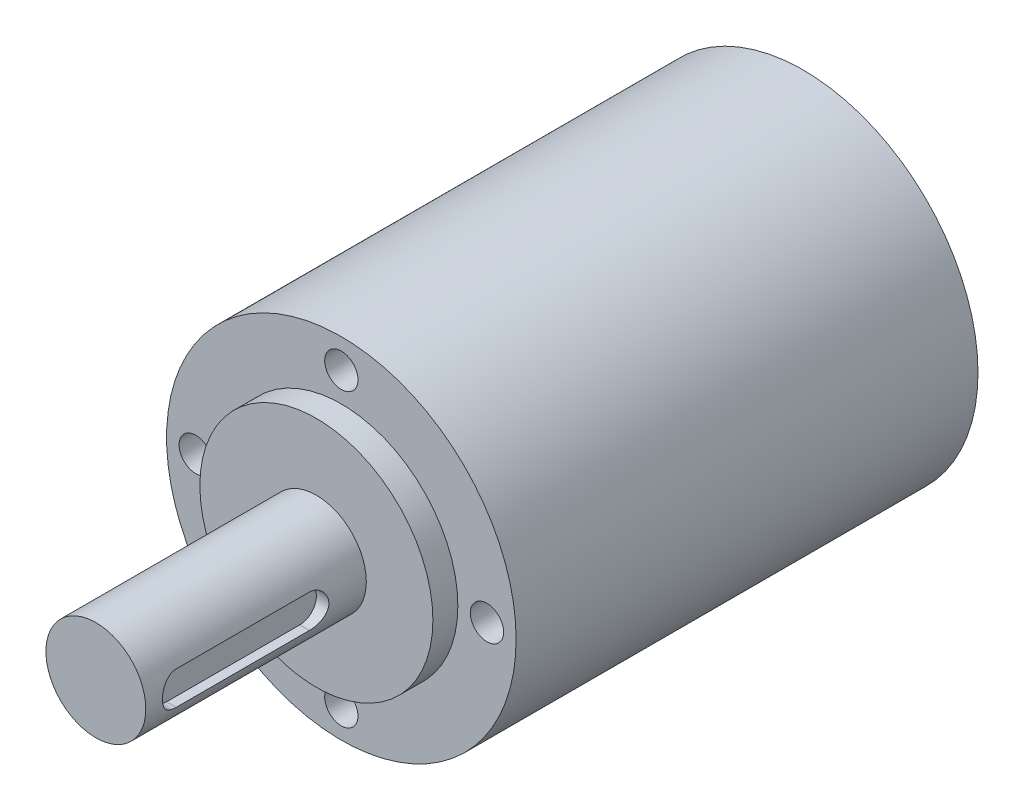
ISO-10303-21;
HEADER;
FILE_DESCRIPTION(('STEP AP214'),'2;1');
FILE_NAME('part.step','',(''),(''),'','','');
FILE_SCHEMA(('AUTOMOTIVE_DESIGN { 1 0 10303 214 1 1 1 1 }'));
ENDSEC;
DATA;
#1=APPLICATION_CONTEXT('core data for automotive mechanical design processes');
#2=APPLICATION_PROTOCOL_DEFINITION('international standard','automotive_design',2000,#1);
#3=PRODUCT_CONTEXT('',#1,'mechanical');
#4=PRODUCT('Part','Part','',(#3));
#5=PRODUCT_RELATED_PRODUCT_CATEGORY('part','',(#4));
#6=PRODUCT_DEFINITION_FORMATION('','',#4);
#7=PRODUCT_DEFINITION_CONTEXT('part definition',#1,'design');
#8=PRODUCT_DEFINITION('design','',#6,#7);
#9=PRODUCT_DEFINITION_SHAPE('','',#8);
#10=(LENGTH_UNIT() NAMED_UNIT(*) SI_UNIT(.MILLI.,.METRE.));
#11=(NAMED_UNIT(*) PLANE_ANGLE_UNIT() SI_UNIT($,.RADIAN.));
#12=(NAMED_UNIT(*) SI_UNIT($,.STERADIAN.) SOLID_ANGLE_UNIT());
#13=UNCERTAINTY_MEASURE_WITH_UNIT(LENGTH_MEASURE(1.E-05),#10,'distance_accuracy_value','');
#14=(GEOMETRIC_REPRESENTATION_CONTEXT(3) GLOBAL_UNCERTAINTY_ASSIGNED_CONTEXT((#13)) GLOBAL_UNIT_ASSIGNED_CONTEXT((#10,
#11,#12)) REPRESENTATION_CONTEXT('',''));
#15=CARTESIAN_POINT('',(0.,0.,0.));
#16=DIRECTION('',(0.,0.,1.));
#17=DIRECTION('',(1.,0.,0.));
#18=AXIS2_PLACEMENT_3D('',#15,#16,#17);
#19=CARTESIAN_POINT('',(0.,0.,85.));
#20=DIRECTION('',(0.,0.,-1.));
#21=DIRECTION('',(-1.,0.,0.));
#22=AXIS2_PLACEMENT_3D('',#19,#20,#21);
#23=CYLINDRICAL_SURFACE('',#22,6.);
#24=CARTESIAN_POINT('',(0.,0.,58.5));
#25=DIRECTION('',(0.,0.,1.));
#26=DIRECTION('',(1.,0.,0.));
#27=AXIS2_PLACEMENT_3D('',#24,#25,#26);
#28=CIRCLE('',#27,6.);
#29=CARTESIAN_POINT('',(6.,0.,58.5));
#30=VERTEX_POINT('',#29);
#31=EDGE_CURVE('E11',#30,#30,#28,.T.);
#32=ORIENTED_EDGE('',*,*,#31,.T.);
#33=EDGE_LOOP('',(#32));
#34=FACE_BOUND('',#33,.T.);
#35=CARTESIAN_POINT('',(0.,0.,85.));
#36=DIRECTION('',(0.,0.,1.));
#37=DIRECTION('',(1.,0.,0.));
#38=AXIS2_PLACEMENT_3D('',#35,#36,#37);
#39=CIRCLE('',#38,6.);
#40=CARTESIAN_POINT('',(6.,0.,85.));
#41=VERTEX_POINT('',#40);
#42=EDGE_CURVE('E174',#41,#41,#39,.T.);
#43=ORIENTED_EDGE('',*,*,#42,.F.);
#44=EDGE_LOOP('',(#43));
#45=FACE_BOUND('',#44,.T.);
#46=DIRECTION('',(0.,0.,-1.));
#47=VECTOR('',#46,1.);
#48=CARTESIAN_POINT('',(5.65685424949238,2.,85.));
#49=LINE('',#48,#47);
#50=CARTESIAN_POINT('',(5.65685424949238,2.,81.));
#51=VERTEX_POINT('',#50);
#52=CARTESIAN_POINT('',(5.65685424949238,2.,65.));
#53=VERTEX_POINT('',#52);
#54=EDGE_CURVE('E345',#51,#53,#49,.T.);
#55=ORIENTED_EDGE('',*,*,#54,.T.);
#56=CARTESIAN_POINT('',(5.65685424949238,2.,65.));
#57=CARTESIAN_POINT('',(5.65685237109221,2.00000290509399,64.9672011654963));
#58=CARTESIAN_POINT('',(5.65713730132393,1.99919931581409,64.9344014118158));
#59=CARTESIAN_POINT('',(5.65827634492172,1.99597452206764,64.8690156716097));
#60=CARTESIAN_POINT('',(5.6591283067542,1.9935594321592,64.8364293454595));
#61=CARTESIAN_POINT('',(5.66139585261597,1.98711045600898,64.771470278464));
#62=CARTESIAN_POINT('',(5.6628108618307,1.98307822067645,64.7390973539161));
#63=CARTESIAN_POINT('',(5.66619198450202,1.97339678978721,64.6745649712504));
#64=CARTESIAN_POINT('',(5.66815906398906,1.96774475949107,64.6424059893939));
#65=CARTESIAN_POINT('',(5.67262846581213,1.95482304796219,64.5783006843322));
#66=CARTESIAN_POINT('',(5.67513316647782,1.9475461727812,64.5463559786066));
#67=CARTESIAN_POINT('',(5.68065778846646,1.93137272178797,64.4826780882254));
#68=CARTESIAN_POINT('',(5.68368129415734,1.92246484674838,64.4509480890172));
#69=CARTESIAN_POINT('',(5.69022592716087,1.90300695880058,64.3876344097755));
#70=CARTESIAN_POINT('',(5.69375250639578,1.89243880570576,64.3560568764517));
#71=CARTESIAN_POINT('',(5.70127120304991,1.86966628021444,64.2931113475774));
#72=CARTESIAN_POINT('',(5.70526849832906,1.85744343466833,64.2617506684285));
#73=CARTESIAN_POINT('',(5.71354221919764,1.83183317059262,64.200360148447));
#74=CARTESIAN_POINT('',(5.71781065877391,1.81847695339783,64.170316199293));
#75=CARTESIAN_POINT('',(5.7266402713839,1.7904762078226,64.1111471576673));
#76=CARTESIAN_POINT('',(5.73119911588845,1.77584164588134,64.0820170074928));
#77=CARTESIAN_POINT('',(5.74058947536847,1.74524718004176,64.0246193661283));
#78=CARTESIAN_POINT('',(5.74542013936331,1.72929134591001,63.9963495676418));
#79=CARTESIAN_POINT('',(5.75531316552222,1.69607483191764,63.9407312125583));
#80=CARTESIAN_POINT('',(5.76037488926229,1.67881767063746,63.9133804417338));
#81=CARTESIAN_POINT('',(5.77069501678384,1.642993103915,63.8595985567651));
#82=CARTESIAN_POINT('',(5.77595337483019,1.6244260022715,63.8331672314941));
#83=CARTESIAN_POINT('',(5.78662924546651,1.58597633243429,63.7812219470439));
#84=CARTESIAN_POINT('',(5.79204707725902,1.56609100980239,63.7557100924071));
#85=CARTESIAN_POINT('',(5.80300198669206,1.52499896157118,63.7056020904724));
#86=CARTESIAN_POINT('',(5.80853949302071,1.50378666323267,63.6810106096791));
#87=CARTESIAN_POINT('',(5.81969128482798,1.46003671396962,63.6327380970056));
#88=CARTESIAN_POINT('',(5.82530583639315,1.43749099715395,63.609064434585));
#89=CARTESIAN_POINT('',(5.83091119273853,1.41438137091684,63.5859542509136));
#90=B_SPLINE_CURVE_WITH_KNOTS('',3,(#56,#57,#58,#59,#60,#61,#62,#63,#64,#65,#66,#67,#68,#69,#70,
#71,#72,#73,#74,#75,#76,#77,#78,#79,#80,#81,#82,#83,#84,#85,#86,#87,#88,#89),.UNSPECIFIED.,.F.,
.F.,(4,2,2,2,2,2,2,2,2,2,2,2,2,2,2,2,4),(0.,0.0983866245339538,0.196402045029843,
0.294317657350006,0.392405685435295,0.490936923593095,0.590178537346878,0.690591430324266,
0.792235500192264,0.891663438411704,0.990375615522207,1.08879430917009,1.18695582939885,
1.28509465856487,1.38344544036046,1.48224130728111,1.58171226131781),.UNSPECIFIED.);
#91=CARTESIAN_POINT('',(5.8309111897553,1.41438138321547,63.5859542783865));
#92=VERTEX_POINT('',#91);
#93=EDGE_CURVE('E165',#53,#92,#90,.T.);
#94=ORIENTED_EDGE('',*,*,#93,.T.);
#95=CARTESIAN_POINT('',(5.99999962427718,0.00212336378699187,63.0000011271688));
#96=CARTESIAN_POINT('',(5.99998836499729,0.0334788628987664,63.0000335715998));
#97=CARTESIAN_POINT('',(5.99971735172455,0.0648330700802963,63.0008050427604));
#98=CARTESIAN_POINT('',(5.99866873282368,0.127889458212275,63.0038403816475));
#99=CARTESIAN_POINT('',(5.99788427023967,0.159590554669923,63.0061244546393));
#100=CARTESIAN_POINT('',(5.99580886374731,0.223265256133307,63.0122399989251));
#101=CARTESIAN_POINT('',(5.99451112740407,0.255236643449875,63.016092243562));
#102=CARTESIAN_POINT('',(5.99140914686318,0.319371392372516,63.0253946771278));
#103=CARTESIAN_POINT('',(5.98959818181759,0.351531346526178,63.0308661149207));
#104=CARTESIAN_POINT('',(5.98546934089039,0.415957123567144,63.0434541157482));
#105=CARTESIAN_POINT('',(5.98314481840872,0.448218289552826,63.050592326813));
#106=CARTESIAN_POINT('',(5.9779900882124,0.512755379946046,63.0665569403711));
#107=CARTESIAN_POINT('',(5.97515333751121,0.545025349889727,63.0754053048639));
#108=CARTESIAN_POINT('',(5.96896907360402,0.609482580558624,63.0948281675989));
#109=CARTESIAN_POINT('',(5.96561503949751,0.64166252599204,63.1054248446108));
#110=CARTESIAN_POINT('',(5.95841513208448,0.705841479986042,63.1283790418158));
#111=CARTESIAN_POINT('',(5.95456309781182,0.737831830221054,63.1407588889515));
#112=CARTESIAN_POINT('',(5.94754905577342,0.791851108216846,63.1632744198752));
#113=CARTESIAN_POINT('',(5.94451352566875,0.814063798230277,63.1730113608061));
#114=CARTESIAN_POINT('',(5.93790040456512,0.860277511190489,63.1942779507579));
#115=CARTESIAN_POINT('',(5.93429891046811,0.884237446253885,63.2058896238093));
#116=CARTESIAN_POINT('',(5.92656269882705,0.933790995722073,63.2311371300643));
#117=CARTESIAN_POINT('',(5.92240919707851,0.959336783675669,63.2448610629451));
#118=CARTESIAN_POINT('',(5.91356165173523,1.01187461757379,63.274574129934));
#119=CARTESIAN_POINT('',(5.90885133666867,1.03881109365644,63.2906567330678));
#120=CARTESIAN_POINT('',(5.89888887757106,1.09390762617861,63.3253343105376));
#121=CARTESIAN_POINT('',(5.89362286046276,1.12200347115065,63.344027364944));
#122=CARTESIAN_POINT('',(5.88254648571688,1.17915679021861,63.3841738613261));
#123=CARTESIAN_POINT('',(5.87672405500991,1.20814047647829,63.4057290738633));
#124=CARTESIAN_POINT('',(5.8645337420073,1.26676459014242,63.4518434227881));
#125=CARTESIAN_POINT('',(5.85815532099062,1.29632071958063,63.47650698883));
#126=CARTESIAN_POINT('',(5.844849902093,1.35574025344209,63.5290684407004));
#127=CARTESIAN_POINT('',(5.83791348738829,1.38550804388082,63.5570721001686));
#128=CARTESIAN_POINT('',(5.8309111897553,1.41438138321545,63.5859542783865));
#129=B_SPLINE_CURVE_WITH_KNOTS('',3,(#95,#96,#97,#98,#99,#100,#101,#102,#103,#104,#105,#106,
#107,#108,#109,#110,#111,#112,#113,#114,#115,#116,#117,#118,#119,#120,#121,#122,#123,#124,#125,
#126,#127,#128),.UNSPECIFIED.,.F.,.F.,(4,2,2,2,2,2,2,2,2,2,2,2,2,2,2,2,4),(0.,
0.0940562459043835,0.189394940071221,0.2860399466611,0.384014174794019,0.483339613364884,
0.584037365614268,0.686127683282016,0.789630000199204,0.862941151702113,0.943522064897031,
1.03137872333601,1.12651565884481,1.22893635729074,1.33864353011731,1.45563930156978,
1.57992534115831),.UNSPECIFIED.);
#130=CARTESIAN_POINT('',(5.99999962427718,0.00212336378699134,63.0000011271688));
#131=VERTEX_POINT('',#130);
#132=EDGE_CURVE('E169',#131,#92,#129,.T.);
#133=ORIENTED_EDGE('',*,*,#132,.F.);
#134=CARTESIAN_POINT('',(5.83103500095731,-1.41387086313102,63.5854438214093));
#135=CARTESIAN_POINT('',(5.8357562806363,-1.39439850096608,63.5659804701736));
#136=CARTESIAN_POINT('',(5.84044664969544,-1.3745201024678,63.5469158978133));
#137=CARTESIAN_POINT('',(5.84957646635963,-1.33476807544218,63.5103373023874));
#138=CARTESIAN_POINT('',(5.85401860260936,-1.31492399698696,63.4927918277037));
#139=CARTESIAN_POINT('',(5.86265210113447,-1.27535724532913,63.4591851713289));
#140=CARTESIAN_POINT('',(5.86684636312859,-1.25566179819635,63.4430926733754));
#141=CARTESIAN_POINT('',(5.87498378205864,-1.21649958109749,63.4123216222768));
#142=CARTESIAN_POINT('',(5.87893009640628,-1.19705781277485,63.397612076733));
#143=CARTESIAN_POINT('',(5.88657138258933,-1.15850078148063,63.3695339449022));
#144=CARTESIAN_POINT('',(5.89026979925785,-1.13940841605642,63.3561348478442));
#145=CARTESIAN_POINT('',(5.8974149438636,-1.10163919703292,63.3306029029834));
#146=CARTESIAN_POINT('',(5.9008654484546,-1.08298325053556,63.3184401707926));
#147=CARTESIAN_POINT('',(5.90751453334395,-1.04616692039146,63.2953051590702));
#148=CARTESIAN_POINT('',(5.91071726447729,-1.02802559490709,63.2843037633226));
#149=CARTESIAN_POINT('',(5.91686999588857,-0.992311928061631,63.263416204276));
#150=CARTESIAN_POINT('',(5.91982460629799,-0.974756848483662,63.2535017794266));
#151=CARTESIAN_POINT('',(5.9280795638272,-0.924445088146589,63.2260835619696));
#152=CARTESIAN_POINT('',(5.93326278719984,-0.891321045901544,63.2092099097112));
#153=CARTESIAN_POINT('',(5.94047370656282,-0.842379292208625,63.1859751861568));
#154=CARTESIAN_POINT('',(5.94268648898886,-0.826931563660791,63.1788812683279));
#155=CARTESIAN_POINT('',(5.94685190245553,-0.796821525371169,63.1655165850674));
#156=CARTESIAN_POINT('',(5.94881214396217,-0.782170826455818,63.1592221036337));
#157=CARTESIAN_POINT('',(5.95345746847181,-0.746251938782605,63.1442967662294));
#158=CARTESIAN_POINT('',(5.95608353037215,-0.724898701967067,63.1358515492012));
#159=CARTESIAN_POINT('',(5.96111142440345,-0.682089697200345,63.1197681699483));
#160=CARTESIAN_POINT('',(5.9635150844352,-0.660636644134356,63.1121233448232));
#161=CARTESIAN_POINT('',(5.96808924797212,-0.617658439965835,63.0976310534141));
#162=CARTESIAN_POINT('',(5.97026167960609,-0.596135734818082,63.0907769452873));
#163=CARTESIAN_POINT('',(5.97437572082033,-0.55304931256741,63.0778559659027));
#164=CARTESIAN_POINT('',(5.97631925612038,-0.531487762611207,63.0717824805823));
#165=CARTESIAN_POINT('',(5.97997486384338,-0.488353274669307,63.0604113840853));
#166=CARTESIAN_POINT('',(5.98168888588813,-0.466782234598461,63.0551072009662));
#167=CARTESIAN_POINT('',(5.98488561295421,-0.423657457916259,63.0452624069354));
#168=CARTESIAN_POINT('',(5.98637028364313,-0.402105355060366,63.0407152780204));
#169=CARTESIAN_POINT('',(5.98910824870009,-0.359046050855037,63.0323713568191));
#170=CARTESIAN_POINT('',(5.990363525828,-0.337540225939083,63.0285681124262));
#171=CARTESIAN_POINT('',(5.99264269305576,-0.294599994854678,63.0216978736621));
#172=CARTESIAN_POINT('',(5.99366858167264,-0.27316671483663,63.0186245044551));
#173=CARTESIAN_POINT('',(5.995488974062,-0.230397030224154,63.0131991394409));
#174=CARTESIAN_POINT('',(5.99628549100595,-0.209061508675293,63.010840857031));
#175=CARTESIAN_POINT('',(5.99764704962429,-0.166511578254728,63.0068300638766));
#176=CARTESIAN_POINT('',(5.99821411888169,-0.145297818267104,63.0051713652535));
#177=CARTESIAN_POINT('',(5.99911049717372,-0.103321877355951,63.0025625495137));
#178=CARTESIAN_POINT('',(5.99944507251872,-0.0825607792663575,63.0015967203196));
#179=CARTESIAN_POINT('',(5.99988874034316,-0.0411991533404363,63.0003182989084));
#180=CARTESIAN_POINT('',(5.99999980178365,-0.020598830181613,63.0000000022261));
#181=CARTESIAN_POINT('',(6.0000000035979,0.000707789866207672,62.9999999999235));
#182=CARTESIAN_POINT('',(5.99999987940697,0.00141557796972257,63.0000003756434));
#183=CARTESIAN_POINT('',(5.99999962427718,0.00212336378699074,63.0000011271688));
#184=B_SPLINE_CURVE_WITH_KNOTS('',3,(#134,#135,#136,#137,#138,#139,#140,#141,#142,#143,#144,
#145,#146,#147,#148,#149,#150,#151,#152,#153,#154,#155,#156,#157,#158,#159,#160,#161,#162,#163,
#164,#165,#166,#167,#168,#169,#170,#171,#172,#173,#174,#175,#176,#177,#178,#179,#180,#181,#182,
#183),.UNSPECIFIED.,.F.,.F.,(4,2,2,2,2,2,2,2,2,2,2,2,2,2,2,2,2,2,2,2,2,2,2,2,4),(0.,
0.083794801425009,0.164348766505625,0.241662400689926,0.31573628406178,0.386571084629594,
0.45416757479159,0.518526651932373,0.579649364458412,0.692179737585877,0.743601718861133,
0.791793876233227,0.861115601936588,0.929804584117017,0.997866518869276,1.06530726121549,
1.13213282950261,1.19834940985973,1.26396336070819,1.32898121731668,1.39340969639229,
1.45725570069763,1.51960371012161,1.58140004118866,1.58352340530752),.UNSPECIFIED.);
#185=CARTESIAN_POINT('',(5.8310350009573,-1.41387086313102,63.5854438214093));
#186=VERTEX_POINT('',#185);
#187=EDGE_CURVE('E135',#186,#131,#184,.T.);
#188=ORIENTED_EDGE('',*,*,#187,.F.);
#189=CARTESIAN_POINT('',(5.65685424949238,-2.,65.));
#190=CARTESIAN_POINT('',(5.65685451745224,-2.00000085651655,64.9688321243257));
#191=CARTESIAN_POINT('',(5.65712982598371,-1.99927146342065,64.9376647724128));
#192=CARTESIAN_POINT('',(5.65821441569948,-1.99633479107285,64.8749028839899));
#193=CARTESIAN_POINT('',(5.65903227214595,-1.99410376936101,64.8433096034954));
#194=CARTESIAN_POINT('',(5.6612017997826,-1.98809814865615,64.779771099825));
#195=CARTESIAN_POINT('',(5.66256191219998,-1.98429910582609,64.7478284772066));
#196=CARTESIAN_POINT('',(5.6658160430653,-1.97509594800325,64.683672554389));
#197=CARTESIAN_POINT('',(5.66771836320992,-1.969666799523,64.651463266862));
#198=CARTESIAN_POINT('',(5.6720575090495,-1.95714512633739,64.586862012543));
#199=CARTESIAN_POINT('',(5.67450249728297,-1.95002707097564,64.5544755444393));
#200=CARTESIAN_POINT('',(5.67992528914291,-1.93407327040716,64.4896139872657));
#201=CARTESIAN_POINT('',(5.6829110726468,-1.92521159969769,64.4571459407331));
#202=CARTESIAN_POINT('',(5.68942265814558,-1.90572159485839,64.3922232939057));
#203=CARTESIAN_POINT('',(5.69295639658421,-1.89506706078037,64.3597773645766));
#204=CARTESIAN_POINT('',(5.70053709381943,-1.87194503709361,64.2950014103161));
#205=CARTESIAN_POINT('',(5.70459139254076,-1.85945114621032,64.2626816415938));
#206=CARTESIAN_POINT('',(5.71174100643911,-1.83746477621153,64.2099161871616));
#207=CARTESIAN_POINT('',(5.7146790593162,-1.82844085612238,64.1892523554821));
#208=CARTESIAN_POINT('',(5.72115351395237,-1.80850901430533,64.1456338333869));
#209=CARTESIAN_POINT('',(5.72471829875725,-1.79750797838998,64.122725798949));
#210=CARTESIAN_POINT('',(5.73243575769765,-1.77335166567169,64.0747843222933));
#211=CARTESIAN_POINT('',(5.73660914841093,-1.76009373536812,64.0498059498217));
#212=CARTESIAN_POINT('',(5.74555372803748,-1.73113442750856,63.9979301686133));
#213=CARTESIAN_POINT('',(5.75034239990236,-1.7153218292456,63.9710977992688));
#214=CARTESIAN_POINT('',(5.76051906852947,-1.68094994000558,63.9157655689645));
#215=CARTESIAN_POINT('',(5.76592143771849,-1.66227193518641,63.8873421054787));
#216=CARTESIAN_POINT('',(5.77732893492313,-1.6218563874351,63.8291278510964));
#217=CARTESIAN_POINT('',(5.78334628019986,-1.59999372693061,63.799426033514));
#218=CARTESIAN_POINT('',(5.79264628760153,-1.56534131459163,63.7549749522459));
#219=CARTESIAN_POINT('',(5.79588332768654,-1.55312340227909,63.7397666284098));
#220=CARTESIAN_POINT('',(5.80251016396494,-1.52779099838888,63.7091616414887));
#221=CARTESIAN_POINT('',(5.80590118116277,-1.51466005965418,63.6937788242552));
#222=CARTESIAN_POINT('',(5.81283586128316,-1.48746468483465,63.6628809519956));
#223=CARTESIAN_POINT('',(5.81638065394391,-1.47338365805647,63.6473807586044));
#224=CARTESIAN_POINT('',(5.82362311129164,-1.44425218087585,63.6163075562057));
#225=CARTESIAN_POINT('',(5.82732183549389,-1.42918504522697,63.6007504339026));
#226=CARTESIAN_POINT('',(5.83103500095731,-1.41387086313102,63.5854438214093));
#227=B_SPLINE_CURVE_WITH_KNOTS('',3,(#189,#190,#191,#192,#193,#194,#195,#196,#197,#198,#199,
#200,#201,#202,#203,#204,#205,#206,#207,#208,#209,#210,#211,#212,#213,#214,#215,#216,#217,#218,
#219,#220,#221,#222,#223,#224,#225,#226),.UNSPECIFIED.,.F.,.F.,(4,2,2,2,2,2,2,2,2,2,2,2,2,2,2,2,
2,2,4),(0.,0.0934931902763795,0.188500464030657,0.285048366327552,0.383162190969961,
0.482866039193909,0.584182876737978,0.687134589104681,0.791742034879819,0.85994627029104,
0.936910795162299,1.0226406574352,1.11713936530336,1.22040939651959,1.33245250870458,
1.39177056502407,1.45328302277235,1.51699002794524,1.58289170963265),.UNSPECIFIED.);
#228=CARTESIAN_POINT('',(5.65685424949238,-2.,65.));
#229=VERTEX_POINT('',#228);
#230=EDGE_CURVE('E130',#229,#186,#227,.T.);
#231=ORIENTED_EDGE('',*,*,#230,.F.);
#232=DIRECTION('',(0.,0.,-1.));
#233=VECTOR('',#232,1.);
#234=CARTESIAN_POINT('',(5.65685424949238,-2.,85.));
#235=LINE('',#234,#233);
#236=CARTESIAN_POINT('',(5.65685424949238,-2.,81.));
#237=VERTEX_POINT('',#236);
#238=EDGE_CURVE('E175',#237,#229,#235,.T.);
#239=ORIENTED_EDGE('',*,*,#238,.F.);
#240=CARTESIAN_POINT('',(5.65685424949238,-2.,81.));
#241=CARTESIAN_POINT('',(5.65685237109221,-2.00000290509398,81.0327988345037));
#242=CARTESIAN_POINT('',(5.65713730132393,-1.99919931581408,81.0655985881841));
#243=CARTESIAN_POINT('',(5.65827634492172,-1.99597452206765,81.1309843283902));
#244=CARTESIAN_POINT('',(5.65912830675419,-1.99355943215921,81.1635706545403));
#245=CARTESIAN_POINT('',(5.66139585261596,-1.987110456009,81.2285297215358));
#246=CARTESIAN_POINT('',(5.66281086183069,-1.98307822067648,81.2609026460836));
#247=CARTESIAN_POINT('',(5.666191984502,-1.97339678978726,81.3254350287492));
#248=CARTESIAN_POINT('',(5.66815906398904,-1.96774475949113,81.3575940106058));
#249=CARTESIAN_POINT('',(5.6726284658121,-1.95482304796228,81.4216993156674));
#250=CARTESIAN_POINT('',(5.67513316647778,-1.94754617278131,81.4536440213929));
#251=CARTESIAN_POINT('',(5.68065778846641,-1.93137272178811,81.5173219117741));
#252=CARTESIAN_POINT('',(5.68368129415729,-1.92246484674854,81.5490519109822));
#253=CARTESIAN_POINT('',(5.69022592716081,-1.90300695880074,81.612365590224));
#254=CARTESIAN_POINT('',(5.69375250639574,-1.8924388057059,81.643943123548));
#255=CARTESIAN_POINT('',(5.70127120304988,-1.86966628021451,81.7068886524224));
#256=CARTESIAN_POINT('',(5.70526849832904,-1.85744343466837,81.7382493315715));
#257=CARTESIAN_POINT('',(5.71354221919762,-1.83183317059268,81.7996398515529));
#258=CARTESIAN_POINT('',(5.71781065877387,-1.81847695339795,81.8296838007067));
#259=CARTESIAN_POINT('',(5.72664027138381,-1.79047620782288,81.8888528423322));
#260=CARTESIAN_POINT('',(5.73119911588833,-1.7758416458817,81.9179829925065));
#261=CARTESIAN_POINT('',(5.74058947536833,-1.74524718004224,81.9753806338708));
#262=CARTESIAN_POINT('',(5.74542013936316,-1.72929134591051,82.0036504323573));
#263=CARTESIAN_POINT('',(5.75531316552205,-1.69607483191821,82.0592687874407));
#264=CARTESIAN_POINT('',(5.76037488926211,-1.67881767063806,82.0866195582653));
#265=CARTESIAN_POINT('',(5.77069501678365,-1.64299310391567,82.140401443234));
#266=CARTESIAN_POINT('',(5.77595337483,-1.6244260022722,82.1668327685049));
#267=CARTESIAN_POINT('',(5.7866292454663,-1.58597633243507,82.2187780529551));
#268=CARTESIAN_POINT('',(5.7920470772588,-1.5660910098032,82.2442899075919));
#269=CARTESIAN_POINT('',(5.80300198669182,-1.52499896157208,82.2943979095266));
#270=CARTESIAN_POINT('',(5.80853949302046,-1.50378666323362,82.3189893903198));
#271=CARTESIAN_POINT('',(5.81969128482772,-1.46003671397066,82.3672619029934));
#272=CARTESIAN_POINT('',(5.82530583639288,-1.43749099715504,82.3909355654139));
#273=CARTESIAN_POINT('',(5.83091119273825,-1.41438137091797,82.4140457490853));
#274=B_SPLINE_CURVE_WITH_KNOTS('',3,(#240,#241,#242,#243,#244,#245,#246,#247,#248,#249,#250,
#251,#252,#253,#254,#255,#256,#257,#258,#259,#260,#261,#262,#263,#264,#265,#266,#267,#268,#269,
#270,#271,#272,#273),.UNSPECIFIED.,.F.,.F.,(4,2,2,2,2,2,2,2,2,2,2,2,2,2,2,2,4),(0.,
0.0983866245338565,0.196402045029647,0.294317657349697,0.392405685434911,0.490936923592591,
0.590178537346265,0.690591430323967,0.792235500192249,0.89166343841121,0.990375615521249,
1.08879430916904,1.18695582939771,1.28509465856362,1.3834454403591,1.48224130727962,
1.5817122613162),.UNSPECIFIED.);
#275=CARTESIAN_POINT('',(5.83091118975503,-1.41438138321657,82.4140457216124));
#276=VERTEX_POINT('',#275);
#277=EDGE_CURVE('E127',#237,#276,#274,.T.);
#278=ORIENTED_EDGE('',*,*,#277,.T.);
#279=CARTESIAN_POINT('',(5.99999962427718,-0.00212336378664193,82.9999988728312));
#280=CARTESIAN_POINT('',(5.99998836499729,-0.0334788628984534,82.9999664284003));
#281=CARTESIAN_POINT('',(5.99971735172455,-0.0648330700800195,82.9991949572397));
#282=CARTESIAN_POINT('',(5.99866873282369,-0.127889458212072,82.9961596183525));
#283=CARTESIAN_POINT('',(5.99788427023967,-0.159590554669758,82.9938755453608));
#284=CARTESIAN_POINT('',(5.99580886374732,-0.223265256133219,82.9877600010749));
#285=CARTESIAN_POINT('',(5.99451112740407,-0.255236643449824,82.983907756438));
#286=CARTESIAN_POINT('',(5.99140914686318,-0.319371392372544,82.9746053228722));
#287=CARTESIAN_POINT('',(5.98959818181758,-0.351531346526246,82.9691338850793));
#288=CARTESIAN_POINT('',(5.98546934089038,-0.415957123567291,82.9565458842518));
#289=CARTESIAN_POINT('',(5.9831448184087,-0.448218289553012,82.949407673187));
#290=CARTESIAN_POINT('',(5.97799008821238,-0.512755379946312,82.9334430596288));
#291=CARTESIAN_POINT('',(5.97515333751118,-0.545025349890032,82.924594695136));
#292=CARTESIAN_POINT('',(5.96896907360398,-0.609482580559007,82.905171832401));
#293=CARTESIAN_POINT('',(5.96561503949747,-0.641662525992463,82.894575155389));
#294=CARTESIAN_POINT('',(5.95841513208442,-0.705841479986543,82.871620958184));
#295=CARTESIAN_POINT('',(5.95456309781175,-0.737831830221595,82.8592411110483));
#296=CARTESIAN_POINT('',(5.94754905577334,-0.791851108217413,82.8367255801246));
#297=CARTESIAN_POINT('',(5.94451352566868,-0.814063798230835,82.8269886391937));
#298=CARTESIAN_POINT('',(5.93790040456503,-0.86027751119104,82.8057220492419));
#299=CARTESIAN_POINT('',(5.93429891046803,-0.884237446254439,82.7941103761904));
#300=CARTESIAN_POINT('',(5.92656269882695,-0.933790995722644,82.7688628699354));
#301=CARTESIAN_POINT('',(5.92240919707842,-0.959336783676252,82.7551389370546));
#302=CARTESIAN_POINT('',(5.91356165173512,-1.01187461757441,82.7254258700656));
#303=CARTESIAN_POINT('',(5.90885133666856,-1.03881109365709,82.7093432669318));
#304=CARTESIAN_POINT('',(5.89888887757092,-1.09390762617931,82.674665689462));
#305=CARTESIAN_POINT('',(5.89362286046261,-1.12200347115138,82.6559726350556));
#306=CARTESIAN_POINT('',(5.88254648571671,-1.17915679021941,82.6158261386734));
#307=CARTESIAN_POINT('',(5.87672405500974,-1.20814047647913,82.5942709261361));
#308=CARTESIAN_POINT('',(5.8645337420071,-1.26676459014334,82.5481565772112));
#309=CARTESIAN_POINT('',(5.85815532099041,-1.29632071958159,82.5234930111692));
#310=CARTESIAN_POINT('',(5.84484990209276,-1.35574025344314,82.4709315592987));
#311=CARTESIAN_POINT('',(5.83791348738803,-1.38550804388191,82.4429278998304));
#312=CARTESIAN_POINT('',(5.83091118975503,-1.41438138321657,82.4140457216124));
#313=B_SPLINE_CURVE_WITH_KNOTS('',3,(#279,#280,#281,#282,#283,#284,#285,#286,#287,#288,#289,
#290,#291,#292,#293,#294,#295,#296,#297,#298,#299,#300,#301,#302,#303,#304,#305,#306,#307,#308,
#309,#310,#311,#312),.UNSPECIFIED.,.F.,.F.,(4,2,2,2,2,2,2,2,2,2,2,2,2,2,2,2,4),(0.,
0.0940562459044923,0.189394940071445,0.286039946661437,0.384014174794476,0.483339613365466,
0.58403736561498,0.686127683282858,0.789630000200179,0.862941151703076,0.943522064898014,
1.03137872333705,1.12651565884595,1.22893635729203,1.33864353011878,1.45563930157147,
1.57992534116027),.UNSPECIFIED.);
#314=CARTESIAN_POINT('',(5.99999962427717,-0.00212336378664025,82.9999988728313));
#315=VERTEX_POINT('',#314);
#316=EDGE_CURVE('E71',#315,#276,#313,.T.);
#317=ORIENTED_EDGE('',*,*,#316,.F.);
#318=CARTESIAN_POINT('',(5.83103500095764,1.41387086312964,82.4145561785921));
#319=CARTESIAN_POINT('',(5.83804730635527,1.38494518742221,82.4434698366485));
#320=CARTESIAN_POINT('',(5.84499320559359,1.35512273312901,82.4715021361337));
#321=CARTESIAN_POINT('',(5.85831645295387,1.29559028824434,82.5241157285034));
#322=CARTESIAN_POINT('',(5.86470327435639,1.26597600436862,82.5488029830623));
#323=CARTESIAN_POINT('',(5.87690925107119,1.20723271601225,82.5949597826089));
#324=CARTESIAN_POINT('',(5.88273900656352,1.17818808683279,82.6165339574865));
#325=CARTESIAN_POINT('',(5.89382888585336,1.12091065892964,82.6567137753565));
#326=CARTESIAN_POINT('',(5.89910115020857,1.09275171040624,82.6754213987478));
#327=CARTESIAN_POINT('',(5.90907495378869,1.03752730339452,82.7101239158545));
#328=CARTESIAN_POINT('',(5.91379044016293,1.01052610493168,82.7262171072453));
#329=CARTESIAN_POINT('',(5.92264716822902,0.95785763167516,82.7559476259904));
#330=CARTESIAN_POINT('',(5.92680476268531,0.932245962630696,82.7696786461263));
#331=CARTESIAN_POINT('',(5.93454800286073,0.882559846787919,82.7949371314144));
#332=CARTESIAN_POINT('',(5.93815252171491,0.858533251143559,82.8065529247333));
#333=CARTESIAN_POINT('',(5.94477048843219,0.812185734191299,82.8278251289508));
#334=CARTESIAN_POINT('',(5.94780793614506,0.789905914746641,82.8375637964855));
#335=CARTESIAN_POINT('',(5.95482362987868,0.735730356790632,82.8600751805493));
#336=CARTESIAN_POINT('',(5.9586746488893,0.703650514247883,82.8724472493891));
#337=CARTESIAN_POINT('',(5.96586974293025,0.639290489056249,82.8953783400394));
#338=CARTESIAN_POINT('',(5.96921998782838,0.607018931785802,82.9059596858499));
#339=CARTESIAN_POINT('',(5.97539384391447,0.542376919912836,82.9253441903328));
#340=CARTESIAN_POINT('',(5.97822398204235,0.510013744288598,82.934169521781));
#341=CARTESIAN_POINT('',(5.9833626732007,0.445289227857281,82.9500802689507));
#342=CARTESIAN_POINT('',(5.98567777315788,0.412933802317188,82.9571876370371));
#343=CARTESIAN_POINT('',(5.9897849538073,0.348319026808706,82.9697060885119));
#344=CARTESIAN_POINT('',(5.99158368246878,0.316064292035974,82.9751388062716));
#345=CARTESIAN_POINT('',(5.99465837891696,0.251740031784087,82.9843559143007));
#346=CARTESIAN_POINT('',(5.99594106620423,0.219673870028642,82.9881615353603));
#347=CARTESIAN_POINT('',(5.99798356470589,0.155810189166744,82.9941759586606));
#348=CARTESIAN_POINT('',(5.99875016407911,0.124014842506122,82.9964055114693));
#349=CARTESIAN_POINT('',(5.99976025378256,0.0607710284991631,82.9993240011195));
#350=CARTESIAN_POINT('',(6.00001059355965,0.0293235995244014,83.0000331153899));
#351=CARTESIAN_POINT('',(5.99999962427718,-0.00212336378664193,82.9999988728312));
#352=B_SPLINE_CURVE_WITH_KNOTS('',3,(#318,#319,#320,#321,#322,#323,#324,#325,#326,#327,#328,
#329,#330,#331,#332,#333,#334,#335,#336,#337,#338,#339,#340,#341,#342,#343,#344,#345,#346,#347,
#348,#349,#350,#351),.UNSPECIFIED.,.F.,.F.,(4,2,2,2,2,2,2,2,2,2,2,2,2,2,2,2,4),(0.,
0.124466275772258,0.241642950962387,0.351531722220658,0.454134745981797,0.549454772204203,
0.637495333275693,0.718261017776687,0.791757879212673,0.895500002980494,0.997834401943779,
1.09878072177288,1.19835943019439,1.29659185030592,1.39350019439584,1.48910759811807,
1.58343815484422),.UNSPECIFIED.);
#353=CARTESIAN_POINT('',(5.83103500095763,1.41387086312966,82.4145561785921));
#354=VERTEX_POINT('',#353);
#355=EDGE_CURVE('E380',#354,#315,#352,.T.);
#356=ORIENTED_EDGE('',*,*,#355,.F.);
#357=CARTESIAN_POINT('',(5.65685424949238,2.,81.));
#358=CARTESIAN_POINT('',(5.65685451745224,2.00000085651655,81.0311678756743));
#359=CARTESIAN_POINT('',(5.65712982598371,1.99927146342064,81.0623352275872));
#360=CARTESIAN_POINT('',(5.65821441569948,1.99633479107284,81.1250971160103));
#361=CARTESIAN_POINT('',(5.65903227214596,1.994103769361,81.1566903965048));
#362=CARTESIAN_POINT('',(5.66120179978261,1.98809814865612,81.2202289001752));
#363=CARTESIAN_POINT('',(5.66256191219999,1.98429910582606,81.2521715227937));
#364=CARTESIAN_POINT('',(5.66581604306532,1.97509594800319,81.3163274456113));
#365=CARTESIAN_POINT('',(5.66771836320995,1.96966679952292,81.3485367331384));
#366=CARTESIAN_POINT('',(5.67205750904954,1.95714512633729,81.4131379874575));
#367=CARTESIAN_POINT('',(5.67450249728301,1.95002707097553,81.4455244555612));
#368=CARTESIAN_POINT('',(5.67992528914296,1.934073270407,81.5103860127349));
#369=CARTESIAN_POINT('',(5.68291107264686,1.92521159969751,81.5428540592675));
#370=CARTESIAN_POINT('',(5.68942265814566,1.90572159485816,81.607776706095));
#371=CARTESIAN_POINT('',(5.6929563965843,1.89506706078012,81.6402226354241));
#372=CARTESIAN_POINT('',(5.70053709381953,1.8719450370933,81.7049985896848));
#373=CARTESIAN_POINT('',(5.70459139254087,1.85945114620997,81.7373183584071));
#374=CARTESIAN_POINT('',(5.71174100643923,1.83746477621116,81.7900838128393));
#375=CARTESIAN_POINT('',(5.71467905931632,1.828440856122,81.8107476445187));
#376=CARTESIAN_POINT('',(5.72115351395249,1.80850901430496,81.8543661666139));
#377=CARTESIAN_POINT('',(5.72471829875737,1.7975079783896,81.8772742010518));
#378=CARTESIAN_POINT('',(5.73243575769777,1.77335166567128,81.9252156777074));
#379=CARTESIAN_POINT('',(5.73660914841106,1.7600937353677,81.9501940501791));
#380=CARTESIAN_POINT('',(5.74555372803762,1.7311344275081,82.0020698313875));
#381=CARTESIAN_POINT('',(5.75034239990251,1.71532182924511,82.028902200732));
#382=CARTESIAN_POINT('',(5.76051906852965,1.68094994000502,82.0842344310364));
#383=CARTESIAN_POINT('',(5.76592143771868,1.66227193518581,82.1126578945222));
#384=CARTESIAN_POINT('',(5.77732893492334,1.6218563874344,82.1708721489046));
#385=CARTESIAN_POINT('',(5.78334628020008,1.59999372692985,82.200573966487));
#386=CARTESIAN_POINT('',(5.79264628760176,1.56534131459077,82.2450250477552));
#387=CARTESIAN_POINT('',(5.79588332768679,1.55312340227819,82.2602333715914));
#388=CARTESIAN_POINT('',(5.8025101639652,1.5277909983879,82.2908383585125));
#389=CARTESIAN_POINT('',(5.80590118116304,1.51466005965316,82.306221175746));
#390=CARTESIAN_POINT('',(5.81283586128345,1.48746468483354,82.3371190480056));
#391=CARTESIAN_POINT('',(5.8163806539442,1.47338365805531,82.3526192413968));
#392=CARTESIAN_POINT('',(5.82362311129195,1.44425218087458,82.3836924437957));
#393=CARTESIAN_POINT('',(5.82732183549421,1.42918504522566,82.3992495660987));
#394=CARTESIAN_POINT('',(5.83103500095764,1.41387086312964,82.4145561785921));
#395=B_SPLINE_CURVE_WITH_KNOTS('',3,(#357,#358,#359,#360,#361,#362,#363,#364,#365,#366,#367,
#368,#369,#370,#371,#372,#373,#374,#375,#376,#377,#378,#379,#380,#381,#382,#383,#384,#385,#386,
#387,#388,#389,#390,#391,#392,#393,#394),.UNSPECIFIED.,.F.,.F.,(4,2,2,2,2,2,2,2,2,2,2,2,2,2,2,2,
2,2,4),(0.,0.0934931902764768,0.18850046403088,0.285048366327888,0.383162190970415,
0.482866039194482,0.584182876738677,0.687134589105526,0.791742034880803,0.859946270291934,
0.936910795163163,1.02264065743612,1.11713936530435,1.22040939652073,1.33245250870595,
1.39177056502557,1.45328302277398,1.51699002794703,1.58289170963462),.UNSPECIFIED.);
#396=EDGE_CURVE('E213',#51,#354,#395,.T.);
#397=ORIENTED_EDGE('',*,*,#396,.F.);
#398=EDGE_LOOP('',(#55,#94,#133,#188,#231,#239,#278,#317,#356,#397));
#399=FACE_BOUND('',#398,.T.);
#400=ADVANCED_FACE('F44',(#34,#45,#399),#23,.T.);
#401=CARTESIAN_POINT('',(0.,0.,55.5));
#402=DIRECTION('',(0.,0.,-1.));
#403=DIRECTION('',(-1.,0.,0.));
#404=AXIS2_PLACEMENT_3D('',#401,#402,#403);
#405=CYLINDRICAL_SURFACE('',#404,21.);
#406=CARTESIAN_POINT('',(0.,0.,55.5));
#407=DIRECTION('',(0.,0.,1.));
#408=DIRECTION('',(1.,0.,0.));
#409=AXIS2_PLACEMENT_3D('',#406,#407,#408);
#410=CIRCLE('',#409,21.);
#411=CARTESIAN_POINT('',(21.,0.,55.5));
#412=VERTEX_POINT('',#411);
#413=EDGE_CURVE('E55',#412,#412,#410,.T.);
#414=ORIENTED_EDGE('',*,*,#413,.F.);
#415=EDGE_LOOP('',(#414));
#416=FACE_BOUND('',#415,.T.);
#417=CARTESIAN_POINT('',(0.,0.,0.));
#418=DIRECTION('',(0.,0.,1.));
#419=DIRECTION('',(1.,0.,0.));
#420=AXIS2_PLACEMENT_3D('',#417,#418,#419);
#421=CIRCLE('',#420,21.);
#422=CARTESIAN_POINT('',(21.,0.,0.));
#423=VERTEX_POINT('',#422);
#424=EDGE_CURVE('E289',#423,#423,#421,.T.);
#425=ORIENTED_EDGE('',*,*,#424,.T.);
#426=EDGE_LOOP('',(#425));
#427=FACE_BOUND('',#426,.T.);
#428=ADVANCED_FACE('F46',(#416,#427),#405,.T.);
#429=CARTESIAN_POINT('',(0.,0.,55.5));
#430=DIRECTION('',(0.,0.,1.));
#431=DIRECTION('',(1.,0.,0.));
#432=AXIS2_PLACEMENT_3D('',#429,#430,#431);
#433=PLANE('',#432);
#434=CARTESIAN_POINT('',(0.,0.,55.5));
#435=DIRECTION('',(0.,0.,1.));
#436=DIRECTION('',(1.,0.,0.));
#437=AXIS2_PLACEMENT_3D('',#434,#435,#436);
#438=CIRCLE('',#437,14.);
#439=CARTESIAN_POINT('',(14.,0.,55.5));
#440=VERTEX_POINT('',#439);
#441=EDGE_CURVE('E329',#440,#440,#438,.T.);
#442=ORIENTED_EDGE('',*,*,#441,.F.);
#443=EDGE_LOOP('',(#442));
#444=FACE_BOUND('',#443,.T.);
#445=CARTESIAN_POINT('',(0.,17.5,55.5));
#446=DIRECTION('',(0.,0.,1.));
#447=DIRECTION('',(1.,0.,0.));
#448=AXIS2_PLACEMENT_3D('',#445,#446,#447);
#449=CIRCLE('',#448,2.);
#450=CARTESIAN_POINT('',(2.,17.5,55.5));
#451=VERTEX_POINT('',#450);
#452=EDGE_CURVE('E298',#451,#451,#449,.T.);
#453=ORIENTED_EDGE('',*,*,#452,.F.);
#454=EDGE_LOOP('',(#453));
#455=FACE_BOUND('',#454,.T.);
#456=CARTESIAN_POINT('',(17.5,0.,55.5));
#457=DIRECTION('',(0.,0.,1.));
#458=DIRECTION('',(1.,0.,0.));
#459=AXIS2_PLACEMENT_3D('',#456,#457,#458);
#460=CIRCLE('',#459,2.);
#461=CARTESIAN_POINT('',(19.5,0.,55.5));
#462=VERTEX_POINT('',#461);
#463=EDGE_CURVE('E322',#462,#462,#460,.T.);
#464=ORIENTED_EDGE('',*,*,#463,.F.);
#465=EDGE_LOOP('',(#464));
#466=FACE_BOUND('',#465,.T.);
#467=CARTESIAN_POINT('',(0.,-17.5,55.5));
#468=DIRECTION('',(0.,0.,1.));
#469=DIRECTION('',(1.,0.,0.));
#470=AXIS2_PLACEMENT_3D('',#467,#468,#469);
#471=CIRCLE('',#470,2.);
#472=CARTESIAN_POINT('',(2.,-17.5,55.5));
#473=VERTEX_POINT('',#472);
#474=EDGE_CURVE('E314',#473,#473,#471,.T.);
#475=ORIENTED_EDGE('',*,*,#474,.F.);
#476=EDGE_LOOP('',(#475));
#477=FACE_BOUND('',#476,.T.);
#478=CARTESIAN_POINT('',(-17.5,0.,55.5));
#479=DIRECTION('',(0.,0.,1.));
#480=DIRECTION('',(1.,0.,0.));
#481=AXIS2_PLACEMENT_3D('',#478,#479,#480);
#482=CIRCLE('',#481,2.);
#483=CARTESIAN_POINT('',(-15.5,0.,55.5));
#484=VERTEX_POINT('',#483);
#485=EDGE_CURVE('E305',#484,#484,#482,.T.);
#486=ORIENTED_EDGE('',*,*,#485,.F.);
#487=EDGE_LOOP('',(#486));
#488=FACE_BOUND('',#487,.T.);
#489=ORIENTED_EDGE('',*,*,#413,.T.);
#490=EDGE_LOOP('',(#489));
#491=FACE_BOUND('',#490,.T.);
#492=ADVANCED_FACE('F279',(#444,#455,#466,#477,#488,#491),#433,.T.);
#493=CARTESIAN_POINT('',(0.,0.,0.));
#494=DIRECTION('',(0.,0.,1.));
#495=DIRECTION('',(1.,0.,0.));
#496=AXIS2_PLACEMENT_3D('',#493,#494,#495);
#497=PLANE('',#496);
#498=ORIENTED_EDGE('',*,*,#424,.F.);
#499=EDGE_LOOP('',(#498));
#500=FACE_BOUND('',#499,.T.);
#501=ADVANCED_FACE('F274',(#500),#497,.F.);
#502=CARTESIAN_POINT('',(-17.5,0.,49.5));
#503=DIRECTION('',(0.,0.,1.));
#504=DIRECTION('',(1.,0.,0.));
#505=AXIS2_PLACEMENT_3D('',#502,#503,#504);
#506=CYLINDRICAL_SURFACE('',#505,2.);
#507=CARTESIAN_POINT('',(-17.5,0.,49.5));
#508=DIRECTION('',(0.,0.,1.));
#509=DIRECTION('',(1.,0.,0.));
#510=AXIS2_PLACEMENT_3D('',#507,#508,#509);
#511=CIRCLE('',#510,2.);
#512=CARTESIAN_POINT('',(-15.5,0.,49.5));
#513=VERTEX_POINT('',#512);
#514=EDGE_CURVE('E301',#513,#513,#511,.T.);
#515=ORIENTED_EDGE('',*,*,#514,.F.);
#516=EDGE_LOOP('',(#515));
#517=FACE_BOUND('',#516,.T.);
#518=ORIENTED_EDGE('',*,*,#485,.T.);
#519=EDGE_LOOP('',(#518));
#520=FACE_BOUND('',#519,.T.);
#521=ADVANCED_FACE('F271',(#517,#520),#506,.F.);
#522=CARTESIAN_POINT('',(-17.5,0.,49.5));
#523=DIRECTION('',(0.,0.,1.));
#524=DIRECTION('',(1.,0.,0.));
#525=AXIS2_PLACEMENT_3D('',#522,#523,#524);
#526=PLANE('',#525);
#527=ORIENTED_EDGE('',*,*,#514,.T.);
#528=EDGE_LOOP('',(#527));
#529=FACE_BOUND('',#528,.T.);
#530=ADVANCED_FACE('F266',(#529),#526,.T.);
#531=CARTESIAN_POINT('',(0.,-17.5,49.5));
#532=DIRECTION('',(0.,0.,1.));
#533=DIRECTION('',(1.,0.,0.));
#534=AXIS2_PLACEMENT_3D('',#531,#532,#533);
#535=CYLINDRICAL_SURFACE('',#534,2.);
#536=CARTESIAN_POINT('',(0.,-17.5,49.5));
#537=DIRECTION('',(0.,0.,1.));
#538=DIRECTION('',(1.,0.,0.));
#539=AXIS2_PLACEMENT_3D('',#536,#537,#538);
#540=CIRCLE('',#539,2.);
#541=CARTESIAN_POINT('',(2.,-17.5,49.5));
#542=VERTEX_POINT('',#541);
#543=EDGE_CURVE('E310',#542,#542,#540,.T.);
#544=ORIENTED_EDGE('',*,*,#543,.F.);
#545=EDGE_LOOP('',(#544));
#546=FACE_BOUND('',#545,.T.);
#547=ORIENTED_EDGE('',*,*,#474,.T.);
#548=EDGE_LOOP('',(#547));
#549=FACE_BOUND('',#548,.T.);
#550=ADVANCED_FACE('F263',(#546,#549),#535,.F.);
#551=CARTESIAN_POINT('',(0.,-17.5,49.5));
#552=DIRECTION('',(0.,0.,1.));
#553=DIRECTION('',(1.,0.,0.));
#554=AXIS2_PLACEMENT_3D('',#551,#552,#553);
#555=PLANE('',#554);
#556=ORIENTED_EDGE('',*,*,#543,.T.);
#557=EDGE_LOOP('',(#556));
#558=FACE_BOUND('',#557,.T.);
#559=ADVANCED_FACE('F258',(#558),#555,.T.);
#560=CARTESIAN_POINT('',(17.5,0.,49.5));
#561=DIRECTION('',(0.,0.,1.));
#562=DIRECTION('',(1.,0.,0.));
#563=AXIS2_PLACEMENT_3D('',#560,#561,#562);
#564=CYLINDRICAL_SURFACE('',#563,2.);
#565=CARTESIAN_POINT('',(17.5,0.,49.5));
#566=DIRECTION('',(0.,0.,1.));
#567=DIRECTION('',(1.,0.,0.));
#568=AXIS2_PLACEMENT_3D('',#565,#566,#567);
#569=CIRCLE('',#568,2.);
#570=CARTESIAN_POINT('',(19.5,0.,49.5));
#571=VERTEX_POINT('',#570);
#572=EDGE_CURVE('E318',#571,#571,#569,.T.);
#573=ORIENTED_EDGE('',*,*,#572,.F.);
#574=EDGE_LOOP('',(#573));
#575=FACE_BOUND('',#574,.T.);
#576=ORIENTED_EDGE('',*,*,#463,.T.);
#577=EDGE_LOOP('',(#576));
#578=FACE_BOUND('',#577,.T.);
#579=ADVANCED_FACE('F255',(#575,#578),#564,.F.);
#580=CARTESIAN_POINT('',(17.5,0.,49.5));
#581=DIRECTION('',(0.,0.,1.));
#582=DIRECTION('',(1.,0.,0.));
#583=AXIS2_PLACEMENT_3D('',#580,#581,#582);
#584=PLANE('',#583);
#585=ORIENTED_EDGE('',*,*,#572,.T.);
#586=EDGE_LOOP('',(#585));
#587=FACE_BOUND('',#586,.T.);
#588=ADVANCED_FACE('F253',(#587),#584,.T.);
#589=CARTESIAN_POINT('',(0.,17.5,49.5));
#590=DIRECTION('',(0.,0.,1.));
#591=DIRECTION('',(1.,0.,0.));
#592=AXIS2_PLACEMENT_3D('',#589,#590,#591);
#593=CYLINDRICAL_SURFACE('',#592,2.);
#594=CARTESIAN_POINT('',(0.,17.5,49.5));
#595=DIRECTION('',(0.,0.,1.));
#596=DIRECTION('',(1.,0.,0.));
#597=AXIS2_PLACEMENT_3D('',#594,#595,#596);
#598=CIRCLE('',#597,2.);
#599=CARTESIAN_POINT('',(2.,17.5,49.5));
#600=VERTEX_POINT('',#599);
#601=EDGE_CURVE('E292',#600,#600,#598,.T.);
#602=ORIENTED_EDGE('',*,*,#601,.F.);
#603=EDGE_LOOP('',(#602));
#604=FACE_BOUND('',#603,.T.);
#605=ORIENTED_EDGE('',*,*,#452,.T.);
#606=EDGE_LOOP('',(#605));
#607=FACE_BOUND('',#606,.T.);
#608=ADVANCED_FACE('F249',(#604,#607),#593,.F.);
#609=CARTESIAN_POINT('',(0.,17.5,49.5));
#610=DIRECTION('',(0.,0.,1.));
#611=DIRECTION('',(1.,0.,0.));
#612=AXIS2_PLACEMENT_3D('',#609,#610,#611);
#613=PLANE('',#612);
#614=ORIENTED_EDGE('',*,*,#601,.T.);
#615=EDGE_LOOP('',(#614));
#616=FACE_BOUND('',#615,.T.);
#617=ADVANCED_FACE('F245',(#616),#613,.T.);
#618=CARTESIAN_POINT('',(0.,0.,58.5));
#619=DIRECTION('',(0.,0.,-1.));
#620=DIRECTION('',(-1.,0.,0.));
#621=AXIS2_PLACEMENT_3D('',#618,#619,#620);
#622=CYLINDRICAL_SURFACE('',#621,14.);
#623=CARTESIAN_POINT('',(0.,0.,58.5));
#624=DIRECTION('',(0.,0.,1.));
#625=DIRECTION('',(1.,0.,0.));
#626=AXIS2_PLACEMENT_3D('',#623,#624,#625);
#627=CIRCLE('',#626,14.);
#628=CARTESIAN_POINT('',(14.,0.,58.5));
#629=VERTEX_POINT('',#628);
#630=EDGE_CURVE('E306',#629,#629,#627,.T.);
#631=ORIENTED_EDGE('',*,*,#630,.F.);
#632=EDGE_LOOP('',(#631));
#633=FACE_BOUND('',#632,.T.);
#634=ORIENTED_EDGE('',*,*,#441,.T.);
#635=EDGE_LOOP('',(#634));
#636=FACE_BOUND('',#635,.T.);
#637=ADVANCED_FACE('F241',(#633,#636),#622,.T.);
#638=CARTESIAN_POINT('',(0.,0.,58.5));
#639=DIRECTION('',(0.,0.,1.));
#640=DIRECTION('',(1.,0.,0.));
#641=AXIS2_PLACEMENT_3D('',#638,#639,#640);
#642=PLANE('',#641);
#643=ORIENTED_EDGE('',*,*,#31,.F.);
#644=EDGE_LOOP('',(#643));
#645=FACE_BOUND('',#644,.T.);
#646=ORIENTED_EDGE('',*,*,#630,.T.);
#647=EDGE_LOOP('',(#646));
#648=FACE_BOUND('',#647,.T.);
#649=ADVANCED_FACE('F237',(#645,#648),#642,.T.);
#650=CARTESIAN_POINT('',(0.,0.,85.));
#651=DIRECTION('',(0.,0.,1.));
#652=DIRECTION('',(1.,0.,0.));
#653=AXIS2_PLACEMENT_3D('',#650,#651,#652);
#654=PLANE('',#653);
#655=ORIENTED_EDGE('',*,*,#42,.T.);
#656=EDGE_LOOP('',(#655));
#657=FACE_BOUND('',#656,.T.);
#658=ADVANCED_FACE('F235',(#657),#654,.T.);
#659=CARTESIAN_POINT('',(4.5,-2.,-0.001000000000001));
#660=DIRECTION('',(0.,1.,0.));
#661=DIRECTION('',(0.,0.,1.));
#662=AXIS2_PLACEMENT_3D('',#659,#660,#661);
#663=PLANE('',#662);
#664=ORIENTED_EDGE('',*,*,#238,.T.);
#665=DIRECTION('',(1.,0.,0.));
#666=VECTOR('',#665,1.);
#667=CARTESIAN_POINT('',(4.5,-2.,65.));
#668=LINE('',#667,#666);
#669=CARTESIAN_POINT('',(4.5,-2.,65.));
#670=VERTEX_POINT('',#669);
#671=EDGE_CURVE('E63',#670,#229,#668,.T.);
#672=ORIENTED_EDGE('',*,*,#671,.F.);
#673=DIRECTION('',(0.,0.,1.));
#674=VECTOR('',#673,1.);
#675=CARTESIAN_POINT('',(4.5,-2.,-0.001000000000001));
#676=LINE('',#675,#674);
#677=CARTESIAN_POINT('',(4.5,-2.,81.));
#678=VERTEX_POINT('',#677);
#679=EDGE_CURVE('E112',#670,#678,#676,.T.);
#680=ORIENTED_EDGE('',*,*,#679,.T.);
#681=DIRECTION('',(1.,0.,0.));
#682=VECTOR('',#681,1.);
#683=CARTESIAN_POINT('',(4.5,-2.,81.));
#684=LINE('',#683,#682);
#685=EDGE_CURVE('E122',#678,#237,#684,.T.);
#686=ORIENTED_EDGE('',*,*,#685,.T.);
#687=EDGE_LOOP('',(#664,#672,#680,#686));
#688=FACE_BOUND('',#687,.T.);
#689=ADVANCED_FACE('F121',(#688),#663,.T.);
#690=CARTESIAN_POINT('',(4.5,0.,81.));
#691=DIRECTION('',(1.,0.,0.));
#692=DIRECTION('',(0.,0.,-1.));
#693=AXIS2_PLACEMENT_3D('',#690,#691,#692);
#694=CYLINDRICAL_SURFACE('',#693,2.);
#695=ORIENTED_EDGE('',*,*,#277,.F.);
#696=ORIENTED_EDGE('',*,*,#685,.F.);
#697=CARTESIAN_POINT('',(4.5,0.,81.));
#698=DIRECTION('',(-1.,0.,0.));
#699=DIRECTION('',(0.,0.,1.));
#700=AXIS2_PLACEMENT_3D('',#697,#698,#699);
#701=CIRCLE('',#700,2.);
#702=CARTESIAN_POINT('',(4.5,2.,81.));
#703=VERTEX_POINT('',#702);
#704=EDGE_CURVE('E108',#678,#703,#701,.T.);
#705=ORIENTED_EDGE('',*,*,#704,.T.);
#706=DIRECTION('',(1.,0.,0.));
#707=VECTOR('',#706,1.);
#708=CARTESIAN_POINT('',(4.5,2.,81.));
#709=LINE('',#708,#707);
#710=EDGE_CURVE('E131',#703,#51,#709,.T.);
#711=ORIENTED_EDGE('',*,*,#710,.T.);
#712=ORIENTED_EDGE('',*,*,#396,.T.);
#713=ORIENTED_EDGE('',*,*,#355,.T.);
#714=ORIENTED_EDGE('',*,*,#316,.T.);
#715=EDGE_LOOP('',(#695,#696,#705,#711,#712,#713,#714));
#716=FACE_BOUND('',#715,.T.);
#717=ADVANCED_FACE('F126',(#716),#694,.F.);
#718=CARTESIAN_POINT('',(4.5,2.,-0.001000000000001));
#719=DIRECTION('',(0.,-1.,0.));
#720=DIRECTION('',(0.,0.,-1.));
#721=AXIS2_PLACEMENT_3D('',#718,#719,#720);
#722=PLANE('',#721);
#723=ORIENTED_EDGE('',*,*,#54,.F.);
#724=ORIENTED_EDGE('',*,*,#710,.F.);
#725=DIRECTION('',(0.,0.,-1.));
#726=VECTOR('',#725,1.);
#727=CARTESIAN_POINT('',(4.5,2.,-0.001000000000001));
#728=LINE('',#727,#726);
#729=CARTESIAN_POINT('',(4.5,2.,65.));
#730=VERTEX_POINT('',#729);
#731=EDGE_CURVE('E113',#703,#730,#728,.T.);
#732=ORIENTED_EDGE('',*,*,#731,.T.);
#733=DIRECTION('',(1.,0.,0.));
#734=VECTOR('',#733,1.);
#735=CARTESIAN_POINT('',(4.5,2.,65.));
#736=LINE('',#735,#734);
#737=EDGE_CURVE('E136',#730,#53,#736,.T.);
#738=ORIENTED_EDGE('',*,*,#737,.T.);
#739=EDGE_LOOP('',(#723,#724,#732,#738));
#740=FACE_BOUND('',#739,.T.);
#741=ADVANCED_FACE('F161',(#740),#722,.T.);
#742=CARTESIAN_POINT('',(4.5,0.,65.));
#743=DIRECTION('',(1.,0.,0.));
#744=DIRECTION('',(0.,0.,-1.));
#745=AXIS2_PLACEMENT_3D('',#742,#743,#744);
#746=CYLINDRICAL_SURFACE('',#745,2.);
#747=ORIENTED_EDGE('',*,*,#93,.F.);
#748=ORIENTED_EDGE('',*,*,#737,.F.);
#749=CARTESIAN_POINT('',(4.5,0.,65.));
#750=DIRECTION('',(-1.,0.,0.));
#751=DIRECTION('',(0.,0.,1.));
#752=AXIS2_PLACEMENT_3D('',#749,#750,#751);
#753=CIRCLE('',#752,2.);
#754=EDGE_CURVE('E150',#730,#670,#753,.T.);
#755=ORIENTED_EDGE('',*,*,#754,.T.);
#756=ORIENTED_EDGE('',*,*,#671,.T.);
#757=ORIENTED_EDGE('',*,*,#230,.T.);
#758=ORIENTED_EDGE('',*,*,#187,.T.);
#759=ORIENTED_EDGE('',*,*,#132,.T.);
#760=EDGE_LOOP('',(#747,#748,#755,#756,#757,#758,#759));
#761=FACE_BOUND('',#760,.T.);
#762=ADVANCED_FACE('F163',(#761),#746,.F.);
#763=CARTESIAN_POINT('',(4.5,0.,81.));
#764=DIRECTION('',(-1.,0.,0.));
#765=DIRECTION('',(0.,0.,1.));
#766=AXIS2_PLACEMENT_3D('',#763,#764,#765);
#767=PLANE('',#766);
#768=ORIENTED_EDGE('',*,*,#679,.F.);
#769=ORIENTED_EDGE('',*,*,#754,.F.);
#770=ORIENTED_EDGE('',*,*,#731,.F.);
#771=ORIENTED_EDGE('',*,*,#704,.F.);
#772=EDGE_LOOP('',(#768,#769,#770,#771));
#773=FACE_BOUND('',#772,.T.);
#774=ADVANCED_FACE('F110',(#773),#767,.F.);
#775=CLOSED_SHELL('',(#400,#428,#492,#501,#521,#530,#550,#559,#579,#588,#608,#617,#637,#649,
#658,#689,#717,#741,#762,#774));
#776=MANIFOLD_SOLID_BREP('B2',#775);
#777=ADVANCED_BREP_SHAPE_REPRESENTATION('',(#18,#776),#14);
#778=SHAPE_DEFINITION_REPRESENTATION(#9,#777);
ENDSEC;
END-ISO-10303-21;
